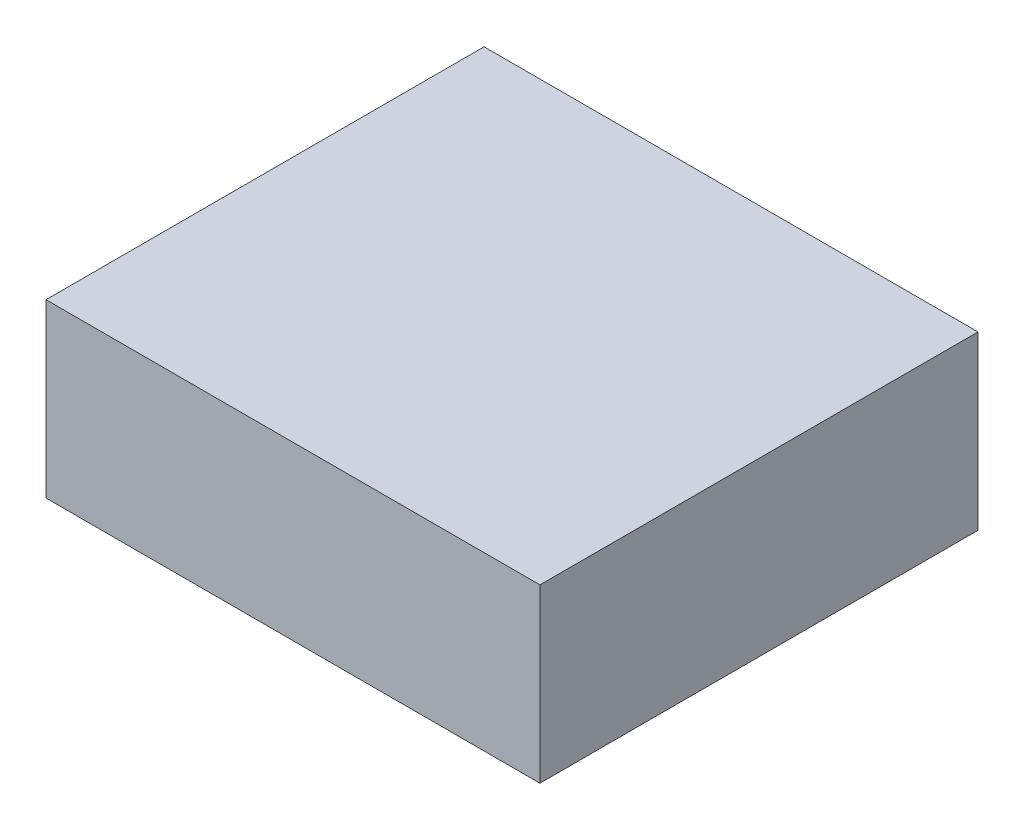
ISO-10303-21;
HEADER;
FILE_DESCRIPTION(('STEP AP214'),'2;1');
FILE_NAME('part.step','',(''),(''),'','','');
FILE_SCHEMA(('AUTOMOTIVE_DESIGN { 1 0 10303 214 1 1 1 1 }'));
ENDSEC;
DATA;
#1=APPLICATION_CONTEXT('core data for automotive mechanical design processes');
#2=APPLICATION_PROTOCOL_DEFINITION('international standard','automotive_design',2000,#1);
#3=PRODUCT_CONTEXT('',#1,'mechanical');
#4=PRODUCT('Part','Part','',(#3));
#5=PRODUCT_RELATED_PRODUCT_CATEGORY('part','',(#4));
#6=PRODUCT_DEFINITION_FORMATION('','',#4);
#7=PRODUCT_DEFINITION_CONTEXT('part definition',#1,'design');
#8=PRODUCT_DEFINITION('design','',#6,#7);
#9=PRODUCT_DEFINITION_SHAPE('','',#8);
#10=(LENGTH_UNIT() NAMED_UNIT(*) SI_UNIT(.MILLI.,.METRE.));
#11=(NAMED_UNIT(*) PLANE_ANGLE_UNIT() SI_UNIT($,.RADIAN.));
#12=(NAMED_UNIT(*) SI_UNIT($,.STERADIAN.) SOLID_ANGLE_UNIT());
#13=UNCERTAINTY_MEASURE_WITH_UNIT(LENGTH_MEASURE(1.E-05),#10,'distance_accuracy_value','');
#14=(GEOMETRIC_REPRESENTATION_CONTEXT(3) GLOBAL_UNCERTAINTY_ASSIGNED_CONTEXT((#13)) GLOBAL_UNIT_ASSIGNED_CONTEXT((#10,
#11,#12)) REPRESENTATION_CONTEXT('',''));
#15=CARTESIAN_POINT('',(0.,0.,0.));
#16=DIRECTION('',(0.,0.,1.));
#17=DIRECTION('',(1.,0.,0.));
#18=AXIS2_PLACEMENT_3D('',#15,#16,#17);
#19=CARTESIAN_POINT('',(0.2875026,0.09999980000001,0.));
#20=DIRECTION('',(0.,-1.,0.));
#21=DIRECTION('',(0.,0.,-1.));
#22=AXIS2_PLACEMENT_3D('',#19,#20,#21);
#23=PLANE('',#22);
#24=DIRECTION('',(0.,0.,-1.));
#25=VECTOR('',#24,1.);
#26=CARTESIAN_POINT('',(-0.28750006,0.09999980000001,0.));
#27=LINE('',#26,#25);
#28=CARTESIAN_POINT('',(-0.28750006,0.09999980000001,0.));
#29=VERTEX_POINT('',#28);
#30=CARTESIAN_POINT('',(-0.28750006,0.09999980000001,0.50999898));
#31=VERTEX_POINT('',#30);
#32=EDGE_CURVE('E20',#29,#31,#27,.F.);
#33=ORIENTED_EDGE('',*,*,#32,.T.);
#34=DIRECTION('',(-1.,0.,0.));
#35=VECTOR('',#34,1.);
#36=CARTESIAN_POINT('',(-0.28750006,0.09999980000001,0.50999898));
#37=LINE('',#36,#35);
#38=CARTESIAN_POINT('',(0.2875026,0.09999980000001,0.50999898));
#39=VERTEX_POINT('',#38);
#40=EDGE_CURVE('E55',#31,#39,#37,.F.);
#41=ORIENTED_EDGE('',*,*,#40,.T.);
#42=DIRECTION('',(0.,0.,1.));
#43=VECTOR('',#42,1.);
#44=CARTESIAN_POINT('',(0.2875026,0.09999980000001,0.));
#45=LINE('',#44,#43);
#46=CARTESIAN_POINT('',(0.2875026,0.09999980000001,0.));
#47=VERTEX_POINT('',#46);
#48=EDGE_CURVE('E76',#39,#47,#45,.F.);
#49=ORIENTED_EDGE('',*,*,#48,.T.);
#50=DIRECTION('',(-1.,0.,0.));
#51=VECTOR('',#50,1.);
#52=CARTESIAN_POINT('',(-0.28750006,0.09999980000001,0.));
#53=LINE('',#52,#51);
#54=EDGE_CURVE('E58',#29,#47,#53,.F.);
#55=ORIENTED_EDGE('',*,*,#54,.F.);
#56=EDGE_LOOP('',(#33,#41,#49,#55));
#57=FACE_BOUND('',#56,.T.);
#58=ADVANCED_FACE('F17',(#57),#23,.F.);
#59=CARTESIAN_POINT('',(-0.28750006,0.09999980000001,0.));
#60=DIRECTION('',(1.,0.,0.));
#61=DIRECTION('',(0.,0.,-1.));
#62=AXIS2_PLACEMENT_3D('',#59,#60,#61);
#63=PLANE('',#62);
#64=DIRECTION('',(0.,0.,1.));
#65=VECTOR('',#64,1.);
#66=CARTESIAN_POINT('',(-0.28750006,-0.09999980000001,0.));
#67=LINE('',#66,#65);
#68=CARTESIAN_POINT('',(-0.28750006,-0.09999980000001,0.));
#69=VERTEX_POINT('',#68);
#70=CARTESIAN_POINT('',(-0.28750006,-0.09999980000001,0.50999898));
#71=VERTEX_POINT('',#70);
#72=EDGE_CURVE('E73',#69,#71,#67,.T.);
#73=ORIENTED_EDGE('',*,*,#72,.T.);
#74=DIRECTION('',(0.,1.,0.));
#75=VECTOR('',#74,1.);
#76=CARTESIAN_POINT('',(-0.28750006,-0.09999980000001,0.50999898));
#77=LINE('',#76,#75);
#78=EDGE_CURVE('E63',#71,#31,#77,.T.);
#79=ORIENTED_EDGE('',*,*,#78,.T.);
#80=ORIENTED_EDGE('',*,*,#32,.F.);
#81=DIRECTION('',(0.,1.,0.));
#82=VECTOR('',#81,1.);
#83=CARTESIAN_POINT('',(-0.28750006,-0.09999980000001,0.));
#84=LINE('',#83,#82);
#85=EDGE_CURVE('E78',#69,#29,#84,.T.);
#86=ORIENTED_EDGE('',*,*,#85,.F.);
#87=EDGE_LOOP('',(#73,#79,#80,#86));
#88=FACE_BOUND('',#87,.T.);
#89=ADVANCED_FACE('F72',(#88),#63,.F.);
#90=CARTESIAN_POINT('',(-0.28750006,-0.09999980000001,0.50999898));
#91=DIRECTION('',(0.,0.,-1.));
#92=DIRECTION('',(-1.,0.,0.));
#93=AXIS2_PLACEMENT_3D('',#90,#91,#92);
#94=PLANE('',#93);
#95=DIRECTION('',(0.,1.,0.));
#96=VECTOR('',#95,1.);
#97=CARTESIAN_POINT('',(0.2875026,-0.09999980000001,0.50999898));
#98=LINE('',#97,#96);
#99=CARTESIAN_POINT('',(0.2875026,-0.09999980000001,0.50999898));
#100=VERTEX_POINT('',#99);
#101=EDGE_CURVE('E69',#100,#39,#98,.T.);
#102=ORIENTED_EDGE('',*,*,#101,.T.);
#103=ORIENTED_EDGE('',*,*,#40,.F.);
#104=ORIENTED_EDGE('',*,*,#78,.F.);
#105=DIRECTION('',(1.,0.,0.));
#106=VECTOR('',#105,1.);
#107=CARTESIAN_POINT('',(-0.28750006,-0.09999980000001,0.50999898));
#108=LINE('',#107,#106);
#109=EDGE_CURVE('E83',#71,#100,#108,.T.);
#110=ORIENTED_EDGE('',*,*,#109,.T.);
#111=EDGE_LOOP('',(#102,#103,#104,#110));
#112=FACE_BOUND('',#111,.T.);
#113=ADVANCED_FACE('F66',(#112),#94,.F.);
#114=CARTESIAN_POINT('',(0.2875026,-0.09999980000001,0.));
#115=DIRECTION('',(-1.,0.,0.));
#116=DIRECTION('',(0.,0.,1.));
#117=AXIS2_PLACEMENT_3D('',#114,#115,#116);
#118=PLANE('',#117);
#119=ORIENTED_EDGE('',*,*,#48,.F.);
#120=ORIENTED_EDGE('',*,*,#101,.F.);
#121=DIRECTION('',(0.,0.,1.));
#122=VECTOR('',#121,1.);
#123=CARTESIAN_POINT('',(0.2875026,-0.09999980000001,0.));
#124=LINE('',#123,#122);
#125=CARTESIAN_POINT('',(0.2875026,-0.09999980000001,0.));
#126=VERTEX_POINT('',#125);
#127=EDGE_CURVE('E26',#100,#126,#124,.F.);
#128=ORIENTED_EDGE('',*,*,#127,.T.);
#129=DIRECTION('',(0.,1.,0.));
#130=VECTOR('',#129,1.);
#131=CARTESIAN_POINT('',(0.2875026,-0.09999980000001,0.));
#132=LINE('',#131,#130);
#133=EDGE_CURVE('E34',#47,#126,#132,.F.);
#134=ORIENTED_EDGE('',*,*,#133,.F.);
#135=EDGE_LOOP('',(#119,#120,#128,#134));
#136=FACE_BOUND('',#135,.T.);
#137=ADVANCED_FACE('F88',(#136),#118,.F.);
#138=CARTESIAN_POINT('',(-0.28750006,-0.09999980000001,0.));
#139=DIRECTION('',(0.,0.,-1.));
#140=DIRECTION('',(-1.,0.,0.));
#141=AXIS2_PLACEMENT_3D('',#138,#139,#140);
#142=PLANE('',#141);
#143=ORIENTED_EDGE('',*,*,#133,.T.);
#144=DIRECTION('',(1.,0.,0.));
#145=VECTOR('',#144,1.);
#146=CARTESIAN_POINT('',(-0.28750006,-0.09999980000001,0.));
#147=LINE('',#146,#145);
#148=EDGE_CURVE('E11',#126,#69,#147,.F.);
#149=ORIENTED_EDGE('',*,*,#148,.T.);
#150=ORIENTED_EDGE('',*,*,#85,.T.);
#151=ORIENTED_EDGE('',*,*,#54,.T.);
#152=EDGE_LOOP('',(#143,#149,#150,#151));
#153=FACE_BOUND('',#152,.T.);
#154=ADVANCED_FACE('F91',(#153),#142,.T.);
#155=CARTESIAN_POINT('',(-0.28750006,-0.09999980000001,0.));
#156=DIRECTION('',(0.,1.,0.));
#157=DIRECTION('',(0.,0.,1.));
#158=AXIS2_PLACEMENT_3D('',#155,#156,#157);
#159=PLANE('',#158);
#160=ORIENTED_EDGE('',*,*,#127,.F.);
#161=ORIENTED_EDGE('',*,*,#109,.F.);
#162=ORIENTED_EDGE('',*,*,#72,.F.);
#163=ORIENTED_EDGE('',*,*,#148,.F.);
#164=EDGE_LOOP('',(#160,#161,#162,#163));
#165=FACE_BOUND('',#164,.T.);
#166=ADVANCED_FACE('F90',(#165),#159,.F.);
#167=CLOSED_SHELL('',(#58,#89,#113,#137,#154,#166));
#168=MANIFOLD_SOLID_BREP('B1',#167);
#169=ADVANCED_BREP_SHAPE_REPRESENTATION('',(#18,#168),#14);
#170=SHAPE_DEFINITION_REPRESENTATION(#9,#169);
ENDSEC;
END-ISO-10303-21;
